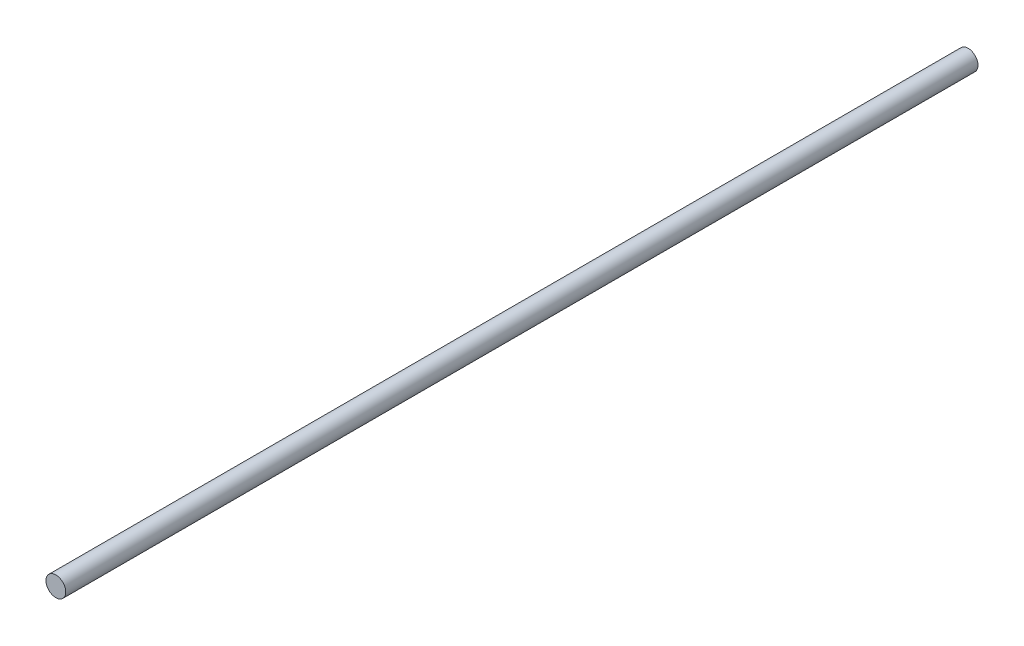
ISO-10303-21;
HEADER;
FILE_DESCRIPTION(('STEP AP214'),'2;1');
FILE_NAME('part.step','',(''),(''),'','','');
FILE_SCHEMA(('AUTOMOTIVE_DESIGN { 1 0 10303 214 1 1 1 1 }'));
ENDSEC;
DATA;
#1=APPLICATION_CONTEXT('core data for automotive mechanical design processes');
#2=APPLICATION_PROTOCOL_DEFINITION('international standard','automotive_design',2000,#1);
#3=PRODUCT_CONTEXT('',#1,'mechanical');
#4=PRODUCT('Part','Part','',(#3));
#5=PRODUCT_RELATED_PRODUCT_CATEGORY('part','',(#4));
#6=PRODUCT_DEFINITION_FORMATION('','',#4);
#7=PRODUCT_DEFINITION_CONTEXT('part definition',#1,'design');
#8=PRODUCT_DEFINITION('design','',#6,#7);
#9=PRODUCT_DEFINITION_SHAPE('','',#8);
#10=(LENGTH_UNIT() NAMED_UNIT(*) SI_UNIT(.MILLI.,.METRE.));
#11=(NAMED_UNIT(*) PLANE_ANGLE_UNIT() SI_UNIT($,.RADIAN.));
#12=(NAMED_UNIT(*) SI_UNIT($,.STERADIAN.) SOLID_ANGLE_UNIT());
#13=UNCERTAINTY_MEASURE_WITH_UNIT(LENGTH_MEASURE(1.E-05),#10,'distance_accuracy_value','');
#14=(GEOMETRIC_REPRESENTATION_CONTEXT(3) GLOBAL_UNCERTAINTY_ASSIGNED_CONTEXT((#13)) GLOBAL_UNIT_ASSIGNED_CONTEXT((#10,
#11,#12)) REPRESENTATION_CONTEXT('',''));
#15=CARTESIAN_POINT('',(0.,0.,0.));
#16=DIRECTION('',(0.,0.,1.));
#17=DIRECTION('',(1.,0.,0.));
#18=AXIS2_PLACEMENT_3D('',#15,#16,#17);
#19=CARTESIAN_POINT('',(0.,0.,304.8));
#20=DIRECTION('',(0.,0.,-1.));
#21=DIRECTION('',(-1.,0.,0.));
#22=AXIS2_PLACEMENT_3D('',#19,#20,#21);
#23=CYLINDRICAL_SURFACE('',#22,3.302);
#24=CARTESIAN_POINT('',(0.,0.,304.8));
#25=DIRECTION('',(0.,0.,1.));
#26=DIRECTION('',(1.,0.,0.));
#27=AXIS2_PLACEMENT_3D('',#24,#25,#26);
#28=CIRCLE('',#27,3.302);
#29=CARTESIAN_POINT('',(3.302,0.,304.8));
#30=VERTEX_POINT('',#29);
#31=EDGE_CURVE('E10',#30,#30,#28,.T.);
#32=ORIENTED_EDGE('',*,*,#31,.F.);
#33=EDGE_LOOP('',(#32));
#34=FACE_BOUND('',#33,.T.);
#35=CARTESIAN_POINT('',(0.,0.,0.));
#36=DIRECTION('',(0.,0.,1.));
#37=DIRECTION('',(1.,0.,0.));
#38=AXIS2_PLACEMENT_3D('',#35,#36,#37);
#39=CIRCLE('',#38,3.302);
#40=CARTESIAN_POINT('',(3.302,0.,0.));
#41=VERTEX_POINT('',#40);
#42=EDGE_CURVE('E40',#41,#41,#39,.T.);
#43=ORIENTED_EDGE('',*,*,#42,.T.);
#44=EDGE_LOOP('',(#43));
#45=FACE_BOUND('',#44,.T.);
#46=ADVANCED_FACE('F37',(#34,#45),#23,.T.);
#47=CARTESIAN_POINT('',(0.,0.,304.8));
#48=DIRECTION('',(0.,0.,1.));
#49=DIRECTION('',(1.,0.,0.));
#50=AXIS2_PLACEMENT_3D('',#47,#48,#49);
#51=PLANE('',#50);
#52=ORIENTED_EDGE('',*,*,#31,.T.);
#53=EDGE_LOOP('',(#52));
#54=FACE_BOUND('',#53,.T.);
#55=ADVANCED_FACE('F54',(#54),#51,.T.);
#56=CARTESIAN_POINT('',(0.,0.,0.));
#57=DIRECTION('',(0.,0.,1.));
#58=DIRECTION('',(1.,0.,0.));
#59=AXIS2_PLACEMENT_3D('',#56,#57,#58);
#60=PLANE('',#59);
#61=ORIENTED_EDGE('',*,*,#42,.F.);
#62=EDGE_LOOP('',(#61));
#63=FACE_BOUND('',#62,.T.);
#64=ADVANCED_FACE('F52',(#63),#60,.F.);
#65=CLOSED_SHELL('',(#46,#55,#64));
#66=MANIFOLD_SOLID_BREP('B2',#65);
#67=ADVANCED_BREP_SHAPE_REPRESENTATION('',(#18,#66),#14);
#68=SHAPE_DEFINITION_REPRESENTATION(#9,#67);
ENDSEC;
END-ISO-10303-21;
